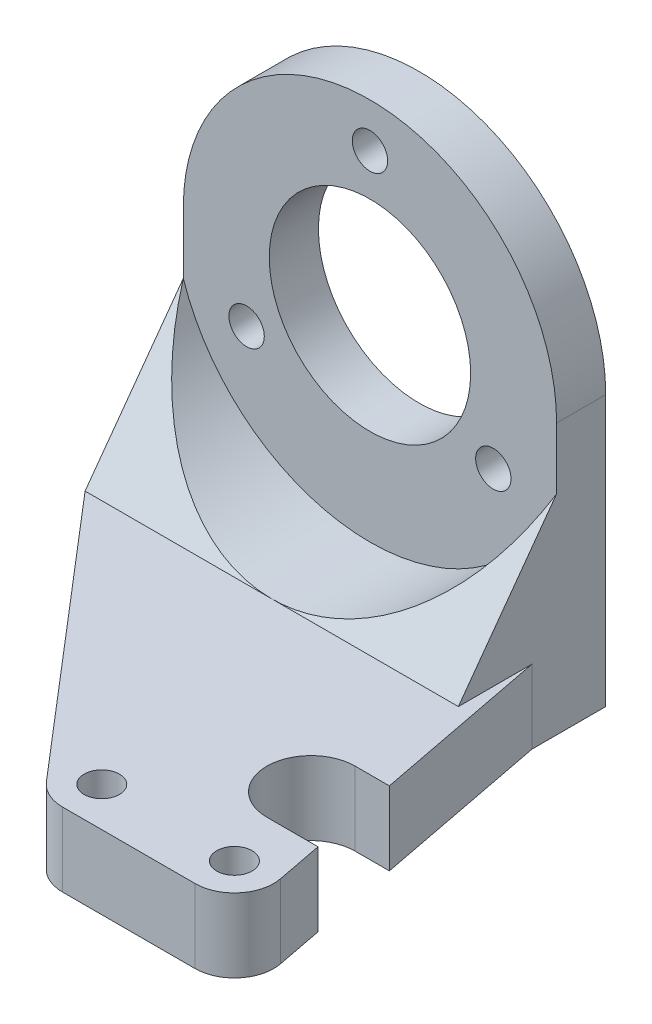
ISO-10303-21;
HEADER;
FILE_DESCRIPTION(('STEP AP214'),'2;1');
FILE_NAME('part.step','',(''),(''),'','','');
FILE_SCHEMA(('AUTOMOTIVE_DESIGN { 1 0 10303 214 1 1 1 1 }'));
ENDSEC;
DATA;
#1=APPLICATION_CONTEXT('core data for automotive mechanical design processes');
#2=APPLICATION_PROTOCOL_DEFINITION('international standard','automotive_design',2000,#1);
#3=PRODUCT_CONTEXT('',#1,'mechanical');
#4=PRODUCT('Part','Part','',(#3));
#5=PRODUCT_RELATED_PRODUCT_CATEGORY('part','',(#4));
#6=PRODUCT_DEFINITION_FORMATION('','',#4);
#7=PRODUCT_DEFINITION_CONTEXT('part definition',#1,'design');
#8=PRODUCT_DEFINITION('design','',#6,#7);
#9=PRODUCT_DEFINITION_SHAPE('','',#8);
#10=(LENGTH_UNIT() NAMED_UNIT(*) SI_UNIT(.MILLI.,.METRE.));
#11=(NAMED_UNIT(*) PLANE_ANGLE_UNIT() SI_UNIT($,.RADIAN.));
#12=(NAMED_UNIT(*) SI_UNIT($,.STERADIAN.) SOLID_ANGLE_UNIT());
#13=UNCERTAINTY_MEASURE_WITH_UNIT(LENGTH_MEASURE(1.E-05),#10,'distance_accuracy_value','');
#14=(GEOMETRIC_REPRESENTATION_CONTEXT(3) GLOBAL_UNCERTAINTY_ASSIGNED_CONTEXT((#13)) GLOBAL_UNIT_ASSIGNED_CONTEXT((#10,
#11,#12)) REPRESENTATION_CONTEXT('',''));
#15=CARTESIAN_POINT('',(0.,0.,0.));
#16=DIRECTION('',(0.,0.,1.));
#17=DIRECTION('',(1.,0.,0.));
#18=AXIS2_PLACEMENT_3D('',#15,#16,#17);
#19=CARTESIAN_POINT('',(16.92160496956,-20.,-3.26657178939987));
#20=DIRECTION('',(0.981872586202194,0.,-0.189542144296764));
#21=DIRECTION('',(-0.189542144296764,0.,-0.981872586202194));
#22=AXIS2_PLACEMENT_3D('',#19,#20,#21);
#23=PLANE('',#22);
#24=DIRECTION('',(0.,-1.,0.));
#25=VECTOR('',#24,1.);
#26=CARTESIAN_POINT('',(24.212120154823,19.,34.5));
#27=LINE('',#26,#25);
#28=CARTESIAN_POINT('',(24.212120154823,-20.,34.5));
#29=VERTEX_POINT('',#28);
#30=CARTESIAN_POINT('',(24.212120154823,-27.5,34.5));
#31=VERTEX_POINT('',#30);
#32=EDGE_CURVE('E182',#29,#31,#27,.T.);
#33=ORIENTED_EDGE('',*,*,#32,.F.);
#34=DIRECTION('',(0.189542144296764,0.,0.981872586202194));
#35=VECTOR('',#34,1.);
#36=CARTESIAN_POINT('',(16.92160496956,-20.,-3.26657178939987));
#37=LINE('',#36,#35);
#38=CARTESIAN_POINT('',(25.1274903448088,-20.,39.2418314228129));
#39=VERTEX_POINT('',#38);
#40=EDGE_CURVE('E231',#29,#39,#37,.T.);
#41=ORIENTED_EDGE('',*,*,#40,.T.);
#42=DIRECTION('',(0.,-1.,0.));
#43=VECTOR('',#42,1.);
#44=CARTESIAN_POINT('',(25.1274903448088,-20.,39.2418314228129));
#45=LINE('',#44,#43);
#46=CARTESIAN_POINT('',(25.1274903448088,-27.5,39.2418314228129));
#47=VERTEX_POINT('',#46);
#48=EDGE_CURVE('E262',#39,#47,#45,.T.);
#49=ORIENTED_EDGE('',*,*,#48,.T.);
#50=DIRECTION('',(0.189542144296764,0.,0.981872586202194));
#51=VECTOR('',#50,1.);
#52=CARTESIAN_POINT('',(16.92160496956,-27.5,-3.26657178939987));
#53=LINE('',#52,#51);
#54=EDGE_CURVE('E252',#31,#47,#53,.T.);
#55=ORIENTED_EDGE('',*,*,#54,.F.);
#56=EDGE_LOOP('',(#33,#41,#49,#55));
#57=FACE_BOUND('',#56,.T.);
#58=ADVANCED_FACE('F41',(#57),#23,.T.);
#59=CARTESIAN_POINT('',(0.,0.,5.));
#60=DIRECTION('',(0.,0.,-1.));
#61=DIRECTION('',(-1.,0.,0.));
#62=AXIS2_PLACEMENT_3D('',#59,#60,#61);
#63=CYLINDRICAL_SURFACE('',#62,19.);
#64=CARTESIAN_POINT('',(0.,0.,0.));
#65=DIRECTION('',(0.,0.,1.));
#66=DIRECTION('',(1.,0.,0.));
#67=AXIS2_PLACEMENT_3D('',#64,#65,#66);
#68=CIRCLE('',#67,19.);
#69=CARTESIAN_POINT('',(19.,0.,0.));
#70=VERTEX_POINT('',#69);
#71=CARTESIAN_POINT('',(-19.,0.,0.));
#72=VERTEX_POINT('',#71);
#73=EDGE_CURVE('E326',#70,#72,#68,.T.);
#74=ORIENTED_EDGE('',*,*,#73,.T.);
#75=DIRECTION('',(0.,0.,-1.));
#76=VECTOR('',#75,1.);
#77=CARTESIAN_POINT('',(-19.,0.,5.));
#78=LINE('',#77,#76);
#79=CARTESIAN_POINT('',(-19.,0.,5.));
#80=VERTEX_POINT('',#79);
#81=EDGE_CURVE('E349',#80,#72,#78,.T.);
#82=ORIENTED_EDGE('',*,*,#81,.F.);
#83=CARTESIAN_POINT('',(0.,0.,5.));
#84=DIRECTION('',(0.,0.,1.));
#85=DIRECTION('',(1.,0.,0.));
#86=AXIS2_PLACEMENT_3D('',#83,#84,#85);
#87=CIRCLE('',#86,19.);
#88=CARTESIAN_POINT('',(19.,0.,5.));
#89=VERTEX_POINT('',#88);
#90=EDGE_CURVE('E310',#89,#80,#87,.T.);
#91=ORIENTED_EDGE('',*,*,#90,.F.);
#92=DIRECTION('',(0.,0.,-1.));
#93=VECTOR('',#92,1.);
#94=CARTESIAN_POINT('',(19.,0.,5.));
#95=LINE('',#94,#93);
#96=EDGE_CURVE('E322',#89,#70,#95,.T.);
#97=ORIENTED_EDGE('',*,*,#96,.T.);
#98=EDGE_LOOP('',(#74,#82,#91,#97));
#99=FACE_BOUND('',#98,.T.);
#100=ADVANCED_FACE('F396',(#99),#63,.T.);
#101=CARTESIAN_POINT('',(-19.,0.,5.));
#102=DIRECTION('',(1.,0.,0.));
#103=DIRECTION('',(0.,0.,-1.));
#104=AXIS2_PLACEMENT_3D('',#101,#102,#103);
#105=PLANE('',#104);
#106=DIRECTION('',(0.,-1.,0.));
#107=VECTOR('',#106,1.);
#108=CARTESIAN_POINT('',(-19.,-20.,15.));
#109=LINE('',#108,#107);
#110=CARTESIAN_POINT('',(-19.,-20.,15.));
#111=VERTEX_POINT('',#110);
#112=CARTESIAN_POINT('',(-19.,-27.5,15.));
#113=VERTEX_POINT('',#112);
#114=EDGE_CURVE('E269',#111,#113,#109,.T.);
#115=ORIENTED_EDGE('',*,*,#114,.F.);
#116=DIRECTION('',(0.,-0.808837826523348,0.588031776679617));
#117=VECTOR('',#116,1.);
#118=CARTESIAN_POINT('',(-19.,-6.2449979983984,5.));
#119=LINE('',#118,#117);
#120=CARTESIAN_POINT('',(-19.,-6.2449979983984,5.));
#121=VERTEX_POINT('',#120);
#122=EDGE_CURVE('E181',#121,#111,#119,.T.);
#123=ORIENTED_EDGE('',*,*,#122,.F.);
#124=DIRECTION('',(0.,-1.,0.));
#125=VECTOR('',#124,1.);
#126=CARTESIAN_POINT('',(-19.,0.,5.));
#127=LINE('',#126,#125);
#128=EDGE_CURVE('E315',#80,#121,#127,.T.);
#129=ORIENTED_EDGE('',*,*,#128,.F.);
#130=ORIENTED_EDGE('',*,*,#81,.T.);
#131=DIRECTION('',(0.,-1.,0.));
#132=VECTOR('',#131,1.);
#133=CARTESIAN_POINT('',(-19.,0.,0.));
#134=LINE('',#133,#132);
#135=CARTESIAN_POINT('',(-19.,-27.5,0.));
#136=VERTEX_POINT('',#135);
#137=EDGE_CURVE('E330',#72,#136,#134,.T.);
#138=ORIENTED_EDGE('',*,*,#137,.T.);
#139=DIRECTION('',(0.,0.,-1.));
#140=VECTOR('',#139,1.);
#141=CARTESIAN_POINT('',(-19.,-27.5,5.));
#142=LINE('',#141,#140);
#143=EDGE_CURVE('E345',#113,#136,#142,.T.);
#144=ORIENTED_EDGE('',*,*,#143,.F.);
#145=EDGE_LOOP('',(#115,#123,#129,#130,#138,#144));
#146=FACE_BOUND('',#145,.T.);
#147=ADVANCED_FACE('F388',(#146),#105,.F.);
#148=CARTESIAN_POINT('',(0.,-27.5,5.));
#149=DIRECTION('',(0.,1.,0.));
#150=DIRECTION('',(0.,0.,1.));
#151=AXIS2_PLACEMENT_3D('',#148,#149,#150);
#152=PLANE('',#151);
#153=CARTESIAN_POINT('',(21.2,-27.5,40.));
#154=DIRECTION('',(0.,-1.,0.));
#155=DIRECTION('',(0.,0.,-1.));
#156=AXIS2_PLACEMENT_3D('',#153,#154,#155);
#157=CIRCLE('',#156,1.79999999999999);
#158=CARTESIAN_POINT('',(21.2,-27.5,38.2));
#159=VERTEX_POINT('',#158);
#160=EDGE_CURVE('E196',#159,#159,#157,.T.);
#161=ORIENTED_EDGE('',*,*,#160,.F.);
#162=EDGE_LOOP('',(#161));
#163=FACE_BOUND('',#162,.T.);
#164=CARTESIAN_POINT('',(7.7,-27.5,40.));
#165=DIRECTION('',(0.,-1.,0.));
#166=DIRECTION('',(0.,0.,-1.));
#167=AXIS2_PLACEMENT_3D('',#164,#165,#166);
#168=CIRCLE('',#167,1.79999999999999);
#169=CARTESIAN_POINT('',(7.7,-27.5,38.2));
#170=VERTEX_POINT('',#169);
#171=EDGE_CURVE('E204',#170,#170,#168,.T.);
#172=ORIENTED_EDGE('',*,*,#171,.F.);
#173=EDGE_LOOP('',(#172));
#174=FACE_BOUND('',#173,.T.);
#175=CARTESIAN_POINT('',(19.,-27.5,30.));
#176=DIRECTION('',(0.,-1.,0.));
#177=DIRECTION('',(0.,0.,-1.));
#178=AXIS2_PLACEMENT_3D('',#175,#176,#177);
#179=CIRCLE('',#178,4.5);
#180=CARTESIAN_POINT('',(19.,-27.5,34.5));
#181=VERTEX_POINT('',#180);
#182=CARTESIAN_POINT('',(19.,-27.5,25.5));
#183=VERTEX_POINT('',#182);
#184=EDGE_CURVE('E160',#181,#183,#179,.T.);
#185=ORIENTED_EDGE('',*,*,#184,.F.);
#186=DIRECTION('',(-1.,0.,0.));
#187=VECTOR('',#186,1.);
#188=CARTESIAN_POINT('',(19.,-27.5,34.5));
#189=LINE('',#188,#187);
#190=EDGE_CURVE('E157',#31,#181,#189,.T.);
#191=ORIENTED_EDGE('',*,*,#190,.F.);
#192=ORIENTED_EDGE('',*,*,#54,.T.);
#193=CARTESIAN_POINT('',(21.2,-27.5,40.));
#194=DIRECTION('',(0.,-1.,0.));
#195=DIRECTION('',(0.,0.,-1.));
#196=AXIS2_PLACEMENT_3D('',#193,#194,#195);
#197=CIRCLE('',#196,4.);
#198=CARTESIAN_POINT('',(21.2,-27.5,44.));
#199=VERTEX_POINT('',#198);
#200=EDGE_CURVE('E218',#47,#199,#197,.T.);
#201=ORIENTED_EDGE('',*,*,#200,.T.);
#202=DIRECTION('',(-1.,0.,0.));
#203=VECTOR('',#202,1.);
#204=CARTESIAN_POINT('',(0.,-27.5,44.));
#205=LINE('',#204,#203);
#206=CARTESIAN_POINT('',(7.7,-27.5,44.));
#207=VERTEX_POINT('',#206);
#208=EDGE_CURVE('E212',#199,#207,#205,.T.);
#209=ORIENTED_EDGE('',*,*,#208,.T.);
#210=CARTESIAN_POINT('',(7.7,-27.5,40.));
#211=DIRECTION('',(0.,-1.,0.));
#212=DIRECTION('',(0.,0.,-1.));
#213=AXIS2_PLACEMENT_3D('',#210,#211,#212);
#214=CIRCLE('',#213,4.);
#215=CARTESIAN_POINT('',(4.66314306749535,-27.5,42.603363203915));
#216=VERTEX_POINT('',#215);
#217=EDGE_CURVE('E244',#207,#216,#214,.T.);
#218=ORIENTED_EDGE('',*,*,#217,.T.);
#219=DIRECTION('',(0.650840800978742,0.,0.759214233126164));
#220=VECTOR('',#219,1.);
#221=CARTESIAN_POINT('',(-18.36363277788,-27.5,15.7423306157234));
#222=LINE('',#221,#220);
#223=EDGE_CURVE('E248',#113,#216,#222,.T.);
#224=ORIENTED_EDGE('',*,*,#223,.F.);
#225=ORIENTED_EDGE('',*,*,#143,.T.);
#226=DIRECTION('',(1.,0.,0.));
#227=VECTOR('',#226,1.);
#228=CARTESIAN_POINT('',(0.,-27.5,0.));
#229=LINE('',#228,#227);
#230=CARTESIAN_POINT('',(19.,-27.5,0.));
#231=VERTEX_POINT('',#230);
#232=EDGE_CURVE('E333',#136,#231,#229,.T.);
#233=ORIENTED_EDGE('',*,*,#232,.T.);
#234=DIRECTION('',(0.,0.,-1.));
#235=VECTOR('',#234,1.);
#236=CARTESIAN_POINT('',(19.,-27.5,5.));
#237=LINE('',#236,#235);
#238=CARTESIAN_POINT('',(19.,-27.5,7.50000000000001));
#239=VERTEX_POINT('',#238);
#240=EDGE_CURVE('E342',#239,#231,#237,.T.);
#241=ORIENTED_EDGE('',*,*,#240,.F.);
#242=CARTESIAN_POINT('',(22.474746769882,-27.5,25.5));
#243=VERTEX_POINT('',#242);
#244=EDGE_CURVE('E173',#239,#243,#53,.T.);
#245=ORIENTED_EDGE('',*,*,#244,.T.);
#246=DIRECTION('',(1.,0.,0.));
#247=VECTOR('',#246,1.);
#248=CARTESIAN_POINT('',(19.,-27.5,25.5));
#249=LINE('',#248,#247);
#250=EDGE_CURVE('E152',#183,#243,#249,.T.);
#251=ORIENTED_EDGE('',*,*,#250,.F.);
#252=EDGE_LOOP('',(#185,#191,#192,#201,#209,#218,#224,#225,#233,#241,#245,#251));
#253=FACE_BOUND('',#252,.T.);
#254=ADVANCED_FACE('F170',(#163,#174,#253),#152,.F.);
#255=CARTESIAN_POINT('',(0.,0.,5.));
#256=DIRECTION('',(0.,0.,-1.));
#257=DIRECTION('',(-1.,0.,0.));
#258=AXIS2_PLACEMENT_3D('',#255,#256,#257);
#259=CYLINDRICAL_SURFACE('',#258,10.25);
#260=CARTESIAN_POINT('',(0.,0.,5.));
#261=DIRECTION('',(0.,0.,1.));
#262=DIRECTION('',(1.,0.,0.));
#263=AXIS2_PLACEMENT_3D('',#260,#261,#262);
#264=CIRCLE('',#263,10.25);
#265=CARTESIAN_POINT('',(10.25,0.,5.));
#266=VERTEX_POINT('',#265);
#267=EDGE_CURVE('E306',#266,#266,#264,.T.);
#268=ORIENTED_EDGE('',*,*,#267,.T.);
#269=EDGE_LOOP('',(#268));
#270=FACE_BOUND('',#269,.T.);
#271=CARTESIAN_POINT('',(0.,0.,0.));
#272=DIRECTION('',(0.,0.,1.));
#273=DIRECTION('',(1.,0.,0.));
#274=AXIS2_PLACEMENT_3D('',#271,#272,#273);
#275=CIRCLE('',#274,10.25);
#276=CARTESIAN_POINT('',(10.25,0.,0.));
#277=VERTEX_POINT('',#276);
#278=EDGE_CURVE('E305',#277,#277,#275,.T.);
#279=ORIENTED_EDGE('',*,*,#278,.F.);
#280=EDGE_LOOP('',(#279));
#281=FACE_BOUND('',#280,.T.);
#282=ADVANCED_FACE('F43',(#270,#281),#259,.F.);
#283=CARTESIAN_POINT('',(19.,0.,5.));
#284=DIRECTION('',(-1.,0.,0.));
#285=DIRECTION('',(0.,0.,1.));
#286=AXIS2_PLACEMENT_3D('',#283,#284,#285);
#287=PLANE('',#286);
#288=DIRECTION('',(0.,1.,0.));
#289=VECTOR('',#288,1.);
#290=CARTESIAN_POINT('',(19.,0.,5.));
#291=LINE('',#290,#289);
#292=CARTESIAN_POINT('',(19.,-6.2449979983984,5.));
#293=VERTEX_POINT('',#292);
#294=EDGE_CURVE('E319',#293,#89,#291,.T.);
#295=ORIENTED_EDGE('',*,*,#294,.F.);
#296=DIRECTION('',(0.,-0.808837826523348,0.588031776679617));
#297=VECTOR('',#296,1.);
#298=CARTESIAN_POINT('',(19.,-2.1594039659377,2.02973941262605));
#299=LINE('',#298,#297);
#300=CARTESIAN_POINT('',(19.,-20.,15.));
#301=VERTEX_POINT('',#300);
#302=EDGE_CURVE('E193',#293,#301,#299,.T.);
#303=ORIENTED_EDGE('',*,*,#302,.T.);
#304=DIRECTION('',(0.,0.,1.));
#305=VECTOR('',#304,1.);
#306=CARTESIAN_POINT('',(19.,-20.,0.));
#307=LINE('',#306,#305);
#308=CARTESIAN_POINT('',(19.,-20.,7.50000000000001));
#309=VERTEX_POINT('',#308);
#310=EDGE_CURVE('E65',#309,#301,#307,.T.);
#311=ORIENTED_EDGE('',*,*,#310,.F.);
#312=DIRECTION('',(0.,-1.,0.));
#313=VECTOR('',#312,1.);
#314=CARTESIAN_POINT('',(19.,-20.,7.5));
#315=LINE('',#314,#313);
#316=EDGE_CURVE('E266',#309,#239,#315,.T.);
#317=ORIENTED_EDGE('',*,*,#316,.T.);
#318=ORIENTED_EDGE('',*,*,#240,.T.);
#319=DIRECTION('',(0.,1.,0.));
#320=VECTOR('',#319,1.);
#321=CARTESIAN_POINT('',(19.,0.,0.));
#322=LINE('',#321,#320);
#323=EDGE_CURVE('E311',#231,#70,#322,.T.);
#324=ORIENTED_EDGE('',*,*,#323,.T.);
#325=ORIENTED_EDGE('',*,*,#96,.F.);
#326=EDGE_LOOP('',(#295,#303,#311,#317,#318,#324,#325));
#327=FACE_BOUND('',#326,.T.);
#328=ADVANCED_FACE('F403',(#327),#287,.F.);
#329=CARTESIAN_POINT('',(0.,0.,5.));
#330=DIRECTION('',(0.,0.,1.));
#331=DIRECTION('',(1.,0.,0.));
#332=AXIS2_PLACEMENT_3D('',#329,#330,#331);
#333=PLANE('',#332);
#334=CARTESIAN_POINT('',(-12.5573683548743,-7.25000000000006,5.));
#335=DIRECTION('',(0.,0.,1.));
#336=DIRECTION('',(1.,0.,0.));
#337=AXIS2_PLACEMENT_3D('',#334,#335,#336);
#338=CIRCLE('',#337,1.8);
#339=CARTESIAN_POINT('',(-10.7573683548743,-7.25000000000006,5.));
#340=VERTEX_POINT('',#339);
#341=EDGE_CURVE('E289',#340,#340,#338,.T.);
#342=ORIENTED_EDGE('',*,*,#341,.F.);
#343=EDGE_LOOP('',(#342));
#344=FACE_BOUND('',#343,.T.);
#345=ORIENTED_EDGE('',*,*,#267,.F.);
#346=EDGE_LOOP('',(#345));
#347=FACE_BOUND('',#346,.T.);
#348=CARTESIAN_POINT('',(12.5573683548744,-7.24999999999988,5.));
#349=DIRECTION('',(0.,0.,1.));
#350=DIRECTION('',(1.,0.,0.));
#351=AXIS2_PLACEMENT_3D('',#348,#349,#350);
#352=CIRCLE('',#351,1.8);
#353=CARTESIAN_POINT('',(14.3573683548744,-7.24999999999988,5.));
#354=VERTEX_POINT('',#353);
#355=EDGE_CURVE('E281',#354,#354,#352,.T.);
#356=ORIENTED_EDGE('',*,*,#355,.F.);
#357=EDGE_LOOP('',(#356));
#358=FACE_BOUND('',#357,.T.);
#359=ORIENTED_EDGE('',*,*,#128,.T.);
#360=CARTESIAN_POINT('',(0.,0.,5.));
#361=DIRECTION('',(0.,0.,1.));
#362=DIRECTION('',(1.,0.,0.));
#363=AXIS2_PLACEMENT_3D('',#360,#361,#362);
#364=CIRCLE('',#363,20.);
#365=EDGE_CURVE('E261',#293,#121,#364,.F.);
#366=ORIENTED_EDGE('',*,*,#365,.F.);
#367=ORIENTED_EDGE('',*,*,#294,.T.);
#368=ORIENTED_EDGE('',*,*,#90,.T.);
#369=EDGE_LOOP('',(#359,#366,#367,#368));
#370=FACE_BOUND('',#369,.T.);
#371=CARTESIAN_POINT('',(0.,14.5,5.));
#372=DIRECTION('',(0.,0.,1.));
#373=DIRECTION('',(1.,0.,0.));
#374=AXIS2_PLACEMENT_3D('',#371,#372,#373);
#375=CIRCLE('',#374,1.8);
#376=CARTESIAN_POINT('',(1.8,14.5,5.));
#377=VERTEX_POINT('',#376);
#378=EDGE_CURVE('E297',#377,#377,#375,.T.);
#379=ORIENTED_EDGE('',*,*,#378,.F.);
#380=EDGE_LOOP('',(#379));
#381=FACE_BOUND('',#380,.T.);
#382=ADVANCED_FACE('F390',(#344,#347,#358,#370,#381),#333,.T.);
#383=CARTESIAN_POINT('',(0.,0.,0.));
#384=DIRECTION('',(0.,0.,1.));
#385=DIRECTION('',(1.,0.,0.));
#386=AXIS2_PLACEMENT_3D('',#383,#384,#385);
#387=PLANE('',#386);
#388=CARTESIAN_POINT('',(12.5573683548744,-7.24999999999988,0.));
#389=DIRECTION('',(0.,0.,1.));
#390=DIRECTION('',(1.,0.,0.));
#391=AXIS2_PLACEMENT_3D('',#388,#389,#390);
#392=CIRCLE('',#391,1.8);
#393=CARTESIAN_POINT('',(14.3573683548744,-7.24999999999988,0.));
#394=VERTEX_POINT('',#393);
#395=EDGE_CURVE('E285',#394,#394,#392,.T.);
#396=ORIENTED_EDGE('',*,*,#395,.T.);
#397=EDGE_LOOP('',(#396));
#398=FACE_BOUND('',#397,.T.);
#399=CARTESIAN_POINT('',(-12.5573683548743,-7.25000000000006,0.));
#400=DIRECTION('',(0.,0.,1.));
#401=DIRECTION('',(1.,0.,0.));
#402=AXIS2_PLACEMENT_3D('',#399,#400,#401);
#403=CIRCLE('',#402,1.8);
#404=CARTESIAN_POINT('',(-10.7573683548743,-7.25000000000006,0.));
#405=VERTEX_POINT('',#404);
#406=EDGE_CURVE('E293',#405,#405,#403,.T.);
#407=ORIENTED_EDGE('',*,*,#406,.T.);
#408=EDGE_LOOP('',(#407));
#409=FACE_BOUND('',#408,.T.);
#410=CARTESIAN_POINT('',(0.,14.5,0.));
#411=DIRECTION('',(0.,0.,1.));
#412=DIRECTION('',(1.,0.,0.));
#413=AXIS2_PLACEMENT_3D('',#410,#411,#412);
#414=CIRCLE('',#413,1.8);
#415=CARTESIAN_POINT('',(1.8,14.5,0.));
#416=VERTEX_POINT('',#415);
#417=EDGE_CURVE('E301',#416,#416,#414,.T.);
#418=ORIENTED_EDGE('',*,*,#417,.T.);
#419=EDGE_LOOP('',(#418));
#420=FACE_BOUND('',#419,.T.);
#421=ORIENTED_EDGE('',*,*,#278,.T.);
#422=EDGE_LOOP('',(#421));
#423=FACE_BOUND('',#422,.T.);
#424=ORIENTED_EDGE('',*,*,#73,.F.);
#425=ORIENTED_EDGE('',*,*,#323,.F.);
#426=ORIENTED_EDGE('',*,*,#232,.F.);
#427=ORIENTED_EDGE('',*,*,#137,.F.);
#428=EDGE_LOOP('',(#424,#425,#426,#427));
#429=FACE_BOUND('',#428,.T.);
#430=ADVANCED_FACE('F402',(#398,#409,#420,#423,#429),#387,.F.);
#431=CARTESIAN_POINT('',(0.,14.5,5.));
#432=DIRECTION('',(0.,0.,1.));
#433=DIRECTION('',(1.,0.,0.));
#434=AXIS2_PLACEMENT_3D('',#431,#432,#433);
#435=CYLINDRICAL_SURFACE('',#434,1.8);
#436=ORIENTED_EDGE('',*,*,#417,.F.);
#437=EDGE_LOOP('',(#436));
#438=FACE_BOUND('',#437,.T.);
#439=ORIENTED_EDGE('',*,*,#378,.T.);
#440=EDGE_LOOP('',(#439));
#441=FACE_BOUND('',#440,.T.);
#442=ADVANCED_FACE('F436',(#438,#441),#435,.F.);
#443=CARTESIAN_POINT('',(-12.5573683548743,-7.25000000000006,5.));
#444=DIRECTION('',(0.,0.,1.));
#445=DIRECTION('',(1.,0.,0.));
#446=AXIS2_PLACEMENT_3D('',#443,#444,#445);
#447=CYLINDRICAL_SURFACE('',#446,1.8);
#448=ORIENTED_EDGE('',*,*,#406,.F.);
#449=EDGE_LOOP('',(#448));
#450=FACE_BOUND('',#449,.T.);
#451=ORIENTED_EDGE('',*,*,#341,.T.);
#452=EDGE_LOOP('',(#451));
#453=FACE_BOUND('',#452,.T.);
#454=ADVANCED_FACE('F443',(#450,#453),#447,.F.);
#455=CARTESIAN_POINT('',(12.5573683548744,-7.24999999999988,5.));
#456=DIRECTION('',(0.,0.,1.));
#457=DIRECTION('',(1.,0.,0.));
#458=AXIS2_PLACEMENT_3D('',#455,#456,#457);
#459=CYLINDRICAL_SURFACE('',#458,1.8);
#460=ORIENTED_EDGE('',*,*,#395,.F.);
#461=EDGE_LOOP('',(#460));
#462=FACE_BOUND('',#461,.T.);
#463=ORIENTED_EDGE('',*,*,#355,.T.);
#464=EDGE_LOOP('',(#463));
#465=FACE_BOUND('',#464,.T.);
#466=ADVANCED_FACE('F447',(#462,#465),#459,.F.);
#467=CARTESIAN_POINT('',(0.,0.,15.));
#468=DIRECTION('',(0.,0.,-1.));
#469=DIRECTION('',(-1.,0.,0.));
#470=AXIS2_PLACEMENT_3D('',#467,#468,#469);
#471=CYLINDRICAL_SURFACE('',#470,20.);
#472=CARTESIAN_POINT('',(0.,0.,0.459834903934406));
#473=DIRECTION('',(0.,-0.588031776679617,-0.808837826523348));
#474=DIRECTION('',(0.,0.808837826523348,-0.588031776679617));
#475=AXIS2_PLACEMENT_3D('',#472,#473,#474);
#476=ELLIPSE('',#475,24.7268356451214,20.);
#477=CARTESIAN_POINT('',(0.,-20.,15.));
#478=VERTEX_POINT('',#477);
#479=EDGE_CURVE('E192',#293,#478,#476,.T.);
#480=ORIENTED_EDGE('',*,*,#479,.F.);
#481=ORIENTED_EDGE('',*,*,#365,.T.);
#482=EDGE_CURVE('E189',#478,#121,#476,.T.);
#483=ORIENTED_EDGE('',*,*,#482,.F.);
#484=EDGE_LOOP('',(#480,#481,#483));
#485=FACE_BOUND('',#484,.T.);
#486=ADVANCED_FACE('F381',(#485),#471,.F.);
#487=CARTESIAN_POINT('',(0.,-20.,44.));
#488=DIRECTION('',(0.,0.,1.));
#489=DIRECTION('',(1.,0.,0.));
#490=AXIS2_PLACEMENT_3D('',#487,#488,#489);
#491=PLANE('',#490);
#492=ORIENTED_EDGE('',*,*,#208,.F.);
#493=DIRECTION('',(0.,-1.,0.));
#494=VECTOR('',#493,1.);
#495=CARTESIAN_POINT('',(21.2,-20.,44.));
#496=LINE('',#495,#494);
#497=CARTESIAN_POINT('',(21.2,-20.,44.));
#498=VERTEX_POINT('',#497);
#499=EDGE_CURVE('E258',#498,#199,#496,.T.);
#500=ORIENTED_EDGE('',*,*,#499,.F.);
#501=DIRECTION('',(-1.,0.,0.));
#502=VECTOR('',#501,1.);
#503=CARTESIAN_POINT('',(0.,-20.,44.));
#504=LINE('',#503,#502);
#505=CARTESIAN_POINT('',(7.7,-20.,44.));
#506=VERTEX_POINT('',#505);
#507=EDGE_CURVE('E213',#498,#506,#504,.T.);
#508=ORIENTED_EDGE('',*,*,#507,.T.);
#509=DIRECTION('',(0.,-1.,0.));
#510=VECTOR('',#509,1.);
#511=CARTESIAN_POINT('',(7.7,-20.,44.));
#512=LINE('',#511,#510);
#513=EDGE_CURVE('E240',#506,#207,#512,.T.);
#514=ORIENTED_EDGE('',*,*,#513,.T.);
#515=EDGE_LOOP('',(#492,#500,#508,#514));
#516=FACE_BOUND('',#515,.T.);
#517=ADVANCED_FACE('F417',(#516),#491,.T.);
#518=CARTESIAN_POINT('',(21.2,-20.,40.));
#519=DIRECTION('',(0.,-1.,0.));
#520=DIRECTION('',(0.,0.,-1.));
#521=AXIS2_PLACEMENT_3D('',#518,#519,#520);
#522=CYLINDRICAL_SURFACE('',#521,4.);
#523=ORIENTED_EDGE('',*,*,#200,.F.);
#524=ORIENTED_EDGE('',*,*,#48,.F.);
#525=CARTESIAN_POINT('',(21.2,-20.,40.));
#526=DIRECTION('',(0.,-1.,0.));
#527=DIRECTION('',(0.,0.,-1.));
#528=AXIS2_PLACEMENT_3D('',#525,#526,#527);
#529=CIRCLE('',#528,4.);
#530=EDGE_CURVE('E236',#39,#498,#529,.T.);
#531=ORIENTED_EDGE('',*,*,#530,.T.);
#532=ORIENTED_EDGE('',*,*,#499,.T.);
#533=EDGE_LOOP('',(#523,#524,#531,#532));
#534=FACE_BOUND('',#533,.T.);
#535=ADVANCED_FACE('F408',(#534),#522,.T.);
#536=DIRECTION('',(0.,-1.,0.));
#537=VECTOR('',#536,1.);
#538=CARTESIAN_POINT('',(22.474746769882,19.,25.5));
#539=LINE('',#538,#537);
#540=CARTESIAN_POINT('',(22.474746769882,-20.,25.5));
#541=VERTEX_POINT('',#540);
#542=EDGE_CURVE('E57',#541,#243,#539,.T.);
#543=ORIENTED_EDGE('',*,*,#542,.T.);
#544=ORIENTED_EDGE('',*,*,#244,.F.);
#545=ORIENTED_EDGE('',*,*,#316,.F.);
#546=EDGE_CURVE('E232',#309,#541,#37,.T.);
#547=ORIENTED_EDGE('',*,*,#546,.T.);
#548=EDGE_LOOP('',(#543,#544,#545,#547));
#549=FACE_BOUND('',#548,.T.);
#550=ADVANCED_FACE('F405',(#549),#23,.T.);
#551=CARTESIAN_POINT('',(-18.36363277788,-20.,15.7423306157234));
#552=DIRECTION('',(0.759214233126164,0.,-0.650840800978742));
#553=DIRECTION('',(-0.650840800978742,0.,-0.759214233126164));
#554=AXIS2_PLACEMENT_3D('',#551,#552,#553);
#555=PLANE('',#554);
#556=ORIENTED_EDGE('',*,*,#223,.T.);
#557=DIRECTION('',(0.,-1.,0.));
#558=VECTOR('',#557,1.);
#559=CARTESIAN_POINT('',(4.66314306749535,-20.,42.603363203915));
#560=LINE('',#559,#558);
#561=CARTESIAN_POINT('',(4.66314306749535,-20.,42.603363203915));
#562=VERTEX_POINT('',#561);
#563=EDGE_CURVE('E273',#562,#216,#560,.T.);
#564=ORIENTED_EDGE('',*,*,#563,.F.);
#565=DIRECTION('',(0.650840800978742,0.,0.759214233126164));
#566=VECTOR('',#565,1.);
#567=CARTESIAN_POINT('',(-18.36363277788,-20.,15.7423306157234));
#568=LINE('',#567,#566);
#569=EDGE_CURVE('E222',#111,#562,#568,.T.);
#570=ORIENTED_EDGE('',*,*,#569,.F.);
#571=ORIENTED_EDGE('',*,*,#114,.T.);
#572=EDGE_LOOP('',(#556,#564,#570,#571));
#573=FACE_BOUND('',#572,.T.);
#574=ADVANCED_FACE('F407',(#573),#555,.F.);
#575=CARTESIAN_POINT('',(7.7,-20.,40.));
#576=DIRECTION('',(0.,-1.,0.));
#577=DIRECTION('',(0.,0.,-1.));
#578=AXIS2_PLACEMENT_3D('',#575,#576,#577);
#579=CYLINDRICAL_SURFACE('',#578,4.);
#580=ORIENTED_EDGE('',*,*,#217,.F.);
#581=ORIENTED_EDGE('',*,*,#513,.F.);
#582=CARTESIAN_POINT('',(7.7,-20.,40.));
#583=DIRECTION('',(0.,-1.,0.));
#584=DIRECTION('',(0.,0.,-1.));
#585=AXIS2_PLACEMENT_3D('',#582,#583,#584);
#586=CIRCLE('',#585,4.);
#587=EDGE_CURVE('E217',#506,#562,#586,.T.);
#588=ORIENTED_EDGE('',*,*,#587,.T.);
#589=ORIENTED_EDGE('',*,*,#563,.T.);
#590=EDGE_LOOP('',(#580,#581,#588,#589));
#591=FACE_BOUND('',#590,.T.);
#592=ADVANCED_FACE('F414',(#591),#579,.T.);
#593=CARTESIAN_POINT('',(0.,-20.,0.));
#594=DIRECTION('',(0.,-1.,0.));
#595=DIRECTION('',(0.,0.,-1.));
#596=AXIS2_PLACEMENT_3D('',#593,#594,#595);
#597=PLANE('',#596);
#598=ORIENTED_EDGE('',*,*,#40,.F.);
#599=DIRECTION('',(-1.,0.,0.));
#600=VECTOR('',#599,1.);
#601=CARTESIAN_POINT('',(0.,-20.,34.5));
#602=LINE('',#601,#600);
#603=CARTESIAN_POINT('',(19.,-20.,34.5));
#604=VERTEX_POINT('',#603);
#605=EDGE_CURVE('E11',#29,#604,#602,.T.);
#606=ORIENTED_EDGE('',*,*,#605,.T.);
#607=CARTESIAN_POINT('',(19.,-20.,30.));
#608=DIRECTION('',(0.,-1.,0.));
#609=DIRECTION('',(0.,0.,-1.));
#610=AXIS2_PLACEMENT_3D('',#607,#608,#609);
#611=CIRCLE('',#610,4.5);
#612=CARTESIAN_POINT('',(19.,-20.,25.5));
#613=VERTEX_POINT('',#612);
#614=EDGE_CURVE('E50',#604,#613,#611,.T.);
#615=ORIENTED_EDGE('',*,*,#614,.T.);
#616=DIRECTION('',(1.,0.,0.));
#617=VECTOR('',#616,1.);
#618=CARTESIAN_POINT('',(0.,-20.,25.5));
#619=LINE('',#618,#617);
#620=EDGE_CURVE('E153',#613,#541,#619,.T.);
#621=ORIENTED_EDGE('',*,*,#620,.T.);
#622=ORIENTED_EDGE('',*,*,#546,.F.);
#623=ORIENTED_EDGE('',*,*,#310,.T.);
#624=DIRECTION('',(-1.,0.,0.));
#625=VECTOR('',#624,1.);
#626=CARTESIAN_POINT('',(0.,-20.,15.));
#627=LINE('',#626,#625);
#628=EDGE_CURVE('E225',#301,#478,#627,.T.);
#629=ORIENTED_EDGE('',*,*,#628,.T.);
#630=DIRECTION('',(1.,0.,0.));
#631=VECTOR('',#630,1.);
#632=CARTESIAN_POINT('',(0.,-20.,15.));
#633=LINE('',#632,#631);
#634=EDGE_CURVE('E353',#111,#478,#633,.T.);
#635=ORIENTED_EDGE('',*,*,#634,.F.);
#636=ORIENTED_EDGE('',*,*,#569,.T.);
#637=ORIENTED_EDGE('',*,*,#587,.F.);
#638=ORIENTED_EDGE('',*,*,#507,.F.);
#639=ORIENTED_EDGE('',*,*,#530,.F.);
#640=EDGE_LOOP('',(#598,#606,#615,#621,#622,#623,#629,#635,#636,#637,#638,#639));
#641=FACE_BOUND('',#640,.T.);
#642=CARTESIAN_POINT('',(7.7,-20.,40.));
#643=DIRECTION('',(0.,-1.,0.));
#644=DIRECTION('',(0.,0.,-1.));
#645=AXIS2_PLACEMENT_3D('',#642,#643,#644);
#646=CIRCLE('',#645,1.79999999999999);
#647=CARTESIAN_POINT('',(7.7,-20.,38.2));
#648=VERTEX_POINT('',#647);
#649=EDGE_CURVE('E208',#648,#648,#646,.T.);
#650=ORIENTED_EDGE('',*,*,#649,.T.);
#651=EDGE_LOOP('',(#650));
#652=FACE_BOUND('',#651,.T.);
#653=CARTESIAN_POINT('',(21.2,-20.,40.));
#654=DIRECTION('',(0.,-1.,0.));
#655=DIRECTION('',(0.,0.,-1.));
#656=AXIS2_PLACEMENT_3D('',#653,#654,#655);
#657=CIRCLE('',#656,1.79999999999999);
#658=CARTESIAN_POINT('',(21.2,-20.,38.2));
#659=VERTEX_POINT('',#658);
#660=EDGE_CURVE('E200',#659,#659,#657,.T.);
#661=ORIENTED_EDGE('',*,*,#660,.T.);
#662=EDGE_LOOP('',(#661));
#663=FACE_BOUND('',#662,.T.);
#664=ADVANCED_FACE('F360',(#641,#652,#663),#597,.F.);
#665=CARTESIAN_POINT('',(7.7,-27.5,40.));
#666=DIRECTION('',(0.,-1.,0.));
#667=DIRECTION('',(0.,0.,-1.));
#668=AXIS2_PLACEMENT_3D('',#665,#666,#667);
#669=CYLINDRICAL_SURFACE('',#668,1.79999999999999);
#670=ORIENTED_EDGE('',*,*,#171,.T.);
#671=EDGE_LOOP('',(#670));
#672=FACE_BOUND('',#671,.T.);
#673=ORIENTED_EDGE('',*,*,#649,.F.);
#674=EDGE_LOOP('',(#673));
#675=FACE_BOUND('',#674,.T.);
#676=ADVANCED_FACE('F462',(#672,#675),#669,.F.);
#677=CARTESIAN_POINT('',(21.2,-27.5,40.));
#678=DIRECTION('',(0.,-1.,0.));
#679=DIRECTION('',(0.,0.,-1.));
#680=AXIS2_PLACEMENT_3D('',#677,#678,#679);
#681=CYLINDRICAL_SURFACE('',#680,1.79999999999999);
#682=ORIENTED_EDGE('',*,*,#160,.T.);
#683=EDGE_LOOP('',(#682));
#684=FACE_BOUND('',#683,.T.);
#685=ORIENTED_EDGE('',*,*,#660,.F.);
#686=EDGE_LOOP('',(#685));
#687=FACE_BOUND('',#686,.T.);
#688=ADVANCED_FACE('F474',(#684,#687),#681,.F.);
#689=CARTESIAN_POINT('',(25.2,-6.2449979983984,5.));
#690=DIRECTION('',(0.,-0.588031776679617,-0.808837826523348));
#691=DIRECTION('',(0.,0.808837826523348,-0.588031776679617));
#692=AXIS2_PLACEMENT_3D('',#689,#690,#691);
#693=PLANE('',#692);
#694=ORIENTED_EDGE('',*,*,#479,.T.);
#695=ORIENTED_EDGE('',*,*,#628,.F.);
#696=ORIENTED_EDGE('',*,*,#302,.F.);
#697=EDGE_LOOP('',(#694,#695,#696));
#698=FACE_BOUND('',#697,.T.);
#699=ADVANCED_FACE('F375',(#698),#693,.F.);
#700=ORIENTED_EDGE('',*,*,#482,.T.);
#701=ORIENTED_EDGE('',*,*,#122,.T.);
#702=ORIENTED_EDGE('',*,*,#634,.T.);
#703=EDGE_LOOP('',(#700,#701,#702));
#704=FACE_BOUND('',#703,.T.);
#705=ADVANCED_FACE('F385',(#704),#693,.F.);
#706=CARTESIAN_POINT('',(19.,19.,30.));
#707=DIRECTION('',(0.,-1.,0.));
#708=DIRECTION('',(0.,0.,-1.));
#709=AXIS2_PLACEMENT_3D('',#706,#707,#708);
#710=CYLINDRICAL_SURFACE('',#709,4.5);
#711=DIRECTION('',(0.,-1.,0.));
#712=VECTOR('',#711,1.);
#713=CARTESIAN_POINT('',(19.,19.,34.5));
#714=LINE('',#713,#712);
#715=EDGE_CURVE('E163',#604,#181,#714,.T.);
#716=ORIENTED_EDGE('',*,*,#715,.T.);
#717=ORIENTED_EDGE('',*,*,#184,.T.);
#718=DIRECTION('',(0.,-1.,0.));
#719=VECTOR('',#718,1.);
#720=CARTESIAN_POINT('',(19.,19.,25.5));
#721=LINE('',#720,#719);
#722=EDGE_CURVE('E148',#613,#183,#721,.T.);
#723=ORIENTED_EDGE('',*,*,#722,.F.);
#724=ORIENTED_EDGE('',*,*,#614,.F.);
#725=EDGE_LOOP('',(#716,#717,#723,#724));
#726=FACE_BOUND('',#725,.T.);
#727=ADVANCED_FACE('F161',(#726),#710,.F.);
#728=CARTESIAN_POINT('',(19.,19.,34.5));
#729=DIRECTION('',(0.,0.,1.));
#730=DIRECTION('',(1.,0.,0.));
#731=AXIS2_PLACEMENT_3D('',#728,#729,#730);
#732=PLANE('',#731);
#733=ORIENTED_EDGE('',*,*,#32,.T.);
#734=ORIENTED_EDGE('',*,*,#190,.T.);
#735=ORIENTED_EDGE('',*,*,#715,.F.);
#736=ORIENTED_EDGE('',*,*,#605,.F.);
#737=EDGE_LOOP('',(#733,#734,#735,#736));
#738=FACE_BOUND('',#737,.T.);
#739=ADVANCED_FACE('F364',(#738),#732,.F.);
#740=CARTESIAN_POINT('',(19.,19.,25.5));
#741=DIRECTION('',(0.,0.,-1.));
#742=DIRECTION('',(-1.,0.,0.));
#743=AXIS2_PLACEMENT_3D('',#740,#741,#742);
#744=PLANE('',#743);
#745=ORIENTED_EDGE('',*,*,#722,.T.);
#746=ORIENTED_EDGE('',*,*,#250,.T.);
#747=ORIENTED_EDGE('',*,*,#542,.F.);
#748=ORIENTED_EDGE('',*,*,#620,.F.);
#749=EDGE_LOOP('',(#745,#746,#747,#748));
#750=FACE_BOUND('',#749,.T.);
#751=ADVANCED_FACE('F150',(#750),#744,.F.);
#752=CLOSED_SHELL('',(#58,#100,#147,#254,#282,#328,#382,#430,#442,#454,#466,#486,#517,#535,#550,
#574,#592,#664,#676,#688,#699,#705,#727,#739,#751));
#753=MANIFOLD_SOLID_BREP('B2',#752);
#754=ADVANCED_BREP_SHAPE_REPRESENTATION('',(#18,#753),#14);
#755=SHAPE_DEFINITION_REPRESENTATION(#9,#754);
ENDSEC;
END-ISO-10303-21;
